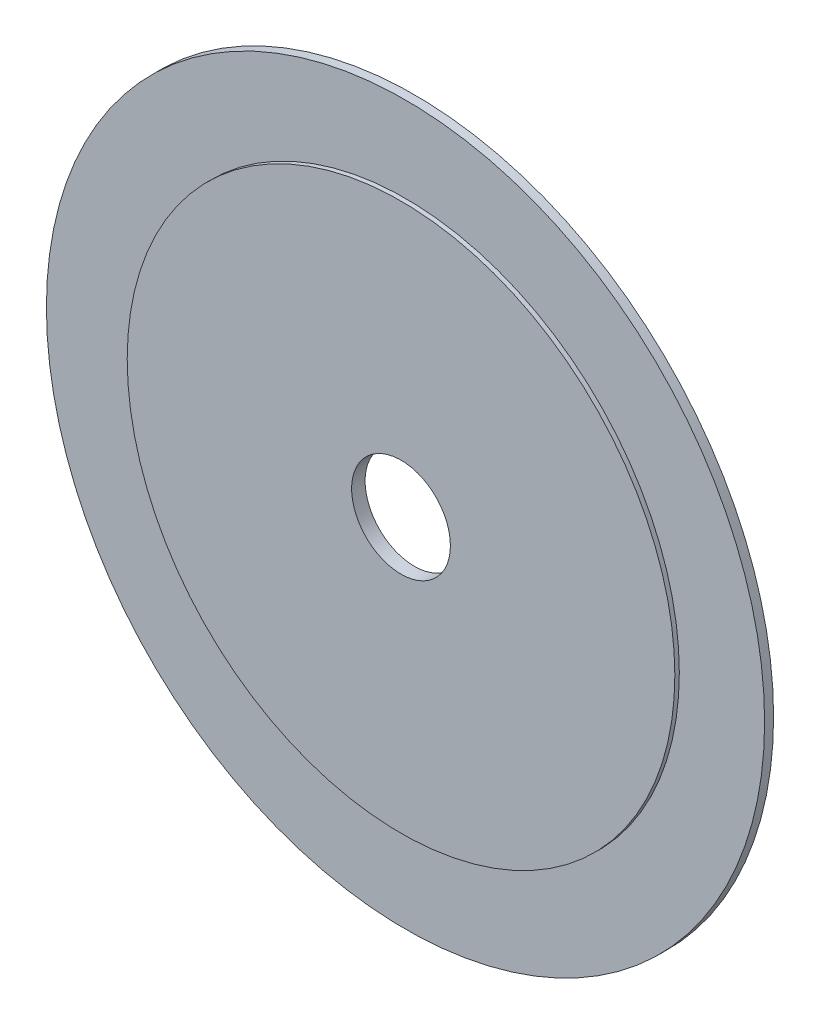
ISO-10303-21;
HEADER;
FILE_DESCRIPTION(('STEP AP214'),'2;1');
FILE_NAME('part.step','',(''),(''),'','','');
FILE_SCHEMA(('AUTOMOTIVE_DESIGN { 1 0 10303 214 1 1 1 1 }'));
ENDSEC;
DATA;
#1=APPLICATION_CONTEXT('core data for automotive mechanical design processes');
#2=APPLICATION_PROTOCOL_DEFINITION('international standard','automotive_design',2000,#1);
#3=PRODUCT_CONTEXT('',#1,'mechanical');
#4=PRODUCT('Part','Part','',(#3));
#5=PRODUCT_RELATED_PRODUCT_CATEGORY('part','',(#4));
#6=PRODUCT_DEFINITION_FORMATION('','',#4);
#7=PRODUCT_DEFINITION_CONTEXT('part definition',#1,'design');
#8=PRODUCT_DEFINITION('design','',#6,#7);
#9=PRODUCT_DEFINITION_SHAPE('','',#8);
#10=(LENGTH_UNIT() NAMED_UNIT(*) SI_UNIT(.MILLI.,.METRE.));
#11=(NAMED_UNIT(*) PLANE_ANGLE_UNIT() SI_UNIT($,.RADIAN.));
#12=(NAMED_UNIT(*) SI_UNIT($,.STERADIAN.) SOLID_ANGLE_UNIT());
#13=UNCERTAINTY_MEASURE_WITH_UNIT(LENGTH_MEASURE(1.E-05),#10,'distance_accuracy_value','');
#14=(GEOMETRIC_REPRESENTATION_CONTEXT(3) GLOBAL_UNCERTAINTY_ASSIGNED_CONTEXT((#13)) GLOBAL_UNIT_ASSIGNED_CONTEXT((#10,
#11,#12)) REPRESENTATION_CONTEXT('',''));
#15=CARTESIAN_POINT('',(0.,0.,0.));
#16=DIRECTION('',(0.,0.,1.));
#17=DIRECTION('',(1.,0.,0.));
#18=AXIS2_PLACEMENT_3D('',#15,#16,#17);
#19=CARTESIAN_POINT('',(0.,0.,3.));
#20=DIRECTION('',(0.,0.,0.999999999999998));
#21=DIRECTION('',(0.999999999999999,0.,0.));
#22=AXIS2_PLACEMENT_3D('',#19,#20,#21);
#23=PLANE('',#22);
#24=CARTESIAN_POINT('',(0.,0.,3.));
#25=DIRECTION('',(0.,0.,0.999999999999998));
#26=DIRECTION('',(0.999999999999999,0.,0.));
#27=AXIS2_PLACEMENT_3D('',#24,#25,#26);
#28=CIRCLE('',#27,11.);
#29=CARTESIAN_POINT('',(11.,0.,3.));
#30=VERTEX_POINT('',#29);
#31=EDGE_CURVE('E114',#30,#30,#28,.T.);
#32=ORIENTED_EDGE('',*,*,#31,.F.);
#33=EDGE_LOOP('',(#32));
#34=FACE_BOUND('',#33,.T.);
#35=CARTESIAN_POINT('',(0.,0.,3.));
#36=DIRECTION('',(0.,0.,0.999999999999998));
#37=DIRECTION('',(0.999999999999999,0.,0.));
#38=AXIS2_PLACEMENT_3D('',#35,#36,#37);
#39=CIRCLE('',#38,61.);
#40=CARTESIAN_POINT('',(60.9999999999999,0.,3.));
#41=VERTEX_POINT('',#40);
#42=EDGE_CURVE('E127',#41,#41,#39,.T.);
#43=ORIENTED_EDGE('',*,*,#42,.T.);
#44=EDGE_LOOP('',(#43));
#45=FACE_BOUND('',#44,.T.);
#46=ADVANCED_FACE('F105',(#34,#45),#23,.T.);
#47=CARTESIAN_POINT('',(0.,0.,3.));
#48=DIRECTION('',(0.,0.,-0.999999999999998));
#49=DIRECTION('',(-0.999999999999999,0.,0.));
#50=AXIS2_PLACEMENT_3D('',#47,#48,#49);
#51=CYLINDRICAL_SURFACE('',#50,80.);
#52=CARTESIAN_POINT('',(0.,0.,0.));
#53=DIRECTION('',(0.,0.,0.999999999999998));
#54=DIRECTION('',(0.999999999999999,0.,0.));
#55=AXIS2_PLACEMENT_3D('',#52,#53,#54);
#56=CIRCLE('',#55,80.);
#57=CARTESIAN_POINT('',(79.9999999999999,0.,0.));
#58=VERTEX_POINT('',#57);
#59=EDGE_CURVE('E14',#58,#58,#56,.T.);
#60=ORIENTED_EDGE('',*,*,#59,.T.);
#61=EDGE_LOOP('',(#60));
#62=FACE_BOUND('',#61,.T.);
#63=CARTESIAN_POINT('',(0.,0.,2.));
#64=DIRECTION('',(0.,0.,0.999999999999998));
#65=DIRECTION('',(0.999999999999999,0.,0.));
#66=AXIS2_PLACEMENT_3D('',#63,#64,#65);
#67=CIRCLE('',#66,80.);
#68=CARTESIAN_POINT('',(79.9999999999999,0.,2.));
#69=VERTEX_POINT('',#68);
#70=EDGE_CURVE('E109',#69,#69,#67,.T.);
#71=ORIENTED_EDGE('',*,*,#70,.F.);
#72=EDGE_LOOP('',(#71));
#73=FACE_BOUND('',#72,.T.);
#74=ADVANCED_FACE('F107',(#62,#73),#51,.T.);
#75=CARTESIAN_POINT('',(0.,0.,0.));
#76=DIRECTION('',(0.,0.,0.999999999999998));
#77=DIRECTION('',(0.999999999999999,0.,0.));
#78=AXIS2_PLACEMENT_3D('',#75,#76,#77);
#79=PLANE('',#78);
#80=ORIENTED_EDGE('',*,*,#59,.F.);
#81=EDGE_LOOP('',(#80));
#82=FACE_BOUND('',#81,.T.);
#83=CARTESIAN_POINT('',(0.,0.,0.));
#84=DIRECTION('',(0.,0.,0.999999999999998));
#85=DIRECTION('',(0.999999999999999,0.,0.));
#86=AXIS2_PLACEMENT_3D('',#83,#84,#85);
#87=CIRCLE('',#86,11.);
#88=CARTESIAN_POINT('',(11.,0.,0.));
#89=VERTEX_POINT('',#88);
#90=EDGE_CURVE('E122',#89,#89,#87,.T.);
#91=ORIENTED_EDGE('',*,*,#90,.T.);
#92=EDGE_LOOP('',(#91));
#93=FACE_BOUND('',#92,.T.);
#94=ADVANCED_FACE('F147',(#82,#93),#79,.F.);
#95=CARTESIAN_POINT('',(0.,0.,3.));
#96=DIRECTION('',(0.,0.,-0.999999999999998));
#97=DIRECTION('',(-0.999999999999999,0.,0.));
#98=AXIS2_PLACEMENT_3D('',#95,#96,#97);
#99=CYLINDRICAL_SURFACE('',#98,11.);
#100=ORIENTED_EDGE('',*,*,#31,.T.);
#101=EDGE_LOOP('',(#100));
#102=FACE_BOUND('',#101,.T.);
#103=ORIENTED_EDGE('',*,*,#90,.F.);
#104=EDGE_LOOP('',(#103));
#105=FACE_BOUND('',#104,.T.);
#106=ADVANCED_FACE('F152',(#102,#105),#99,.F.);
#107=CARTESIAN_POINT('',(0.,0.,2.));
#108=DIRECTION('',(0.,0.,0.999999999999998));
#109=DIRECTION('',(0.999999999999999,0.,0.));
#110=AXIS2_PLACEMENT_3D('',#107,#108,#109);
#111=PLANE('',#110);
#112=CARTESIAN_POINT('',(0.,0.,2.));
#113=DIRECTION('',(0.,0.,0.999999999999998));
#114=DIRECTION('',(0.999999999999999,0.,0.));
#115=AXIS2_PLACEMENT_3D('',#112,#113,#114);
#116=CIRCLE('',#115,61.);
#117=CARTESIAN_POINT('',(60.9999999999999,0.,2.));
#118=VERTEX_POINT('',#117);
#119=EDGE_CURVE('E131',#118,#118,#116,.T.);
#120=ORIENTED_EDGE('',*,*,#119,.F.);
#121=EDGE_LOOP('',(#120));
#122=FACE_BOUND('',#121,.T.);
#123=ORIENTED_EDGE('',*,*,#70,.T.);
#124=EDGE_LOOP('',(#123));
#125=FACE_BOUND('',#124,.T.);
#126=ADVANCED_FACE('F144',(#122,#125),#111,.T.);
#127=CARTESIAN_POINT('',(0.,0.,2.));
#128=DIRECTION('',(0.,0.,0.999999999999998));
#129=DIRECTION('',(0.999999999999999,0.,0.));
#130=AXIS2_PLACEMENT_3D('',#127,#128,#129);
#131=CYLINDRICAL_SURFACE('',#130,61.);
#132=ORIENTED_EDGE('',*,*,#119,.T.);
#133=EDGE_LOOP('',(#132));
#134=FACE_BOUND('',#133,.T.);
#135=ORIENTED_EDGE('',*,*,#42,.F.);
#136=EDGE_LOOP('',(#135));
#137=FACE_BOUND('',#136,.T.);
#138=ADVANCED_FACE('F166',(#134,#137),#131,.T.);
#139=CLOSED_SHELL('',(#46,#74,#94,#106,#126,#138));
#140=MANIFOLD_SOLID_BREP('B2',#139);
#141=ADVANCED_BREP_SHAPE_REPRESENTATION('',(#18,#140),#14);
#142=SHAPE_DEFINITION_REPRESENTATION(#9,#141);
ENDSEC;
END-ISO-10303-21;
